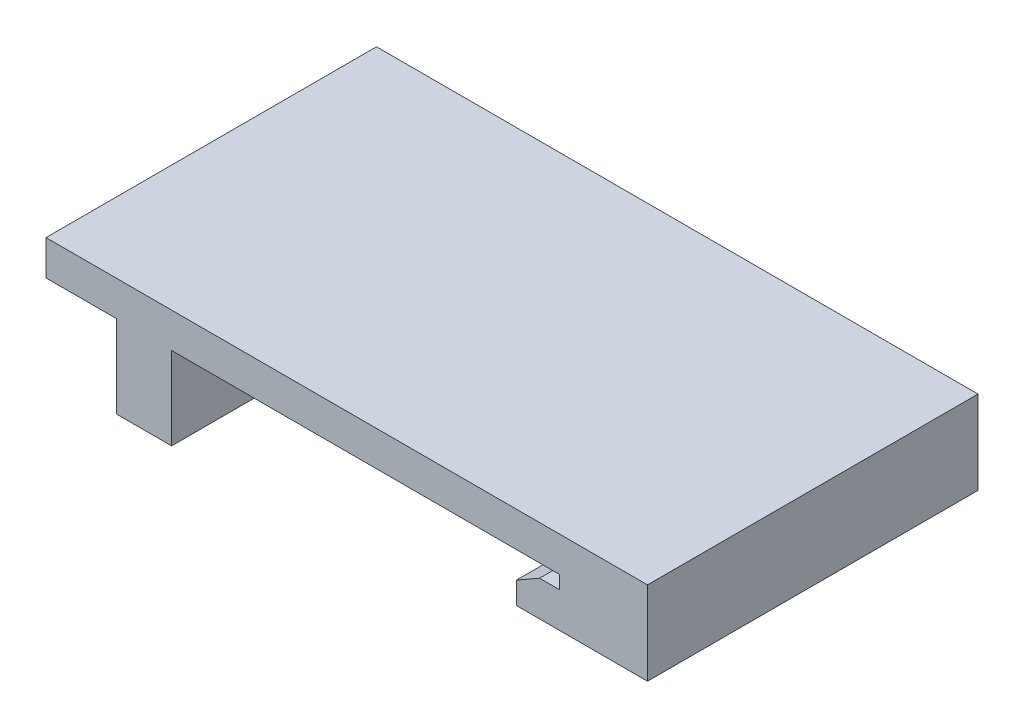
ISO-10303-21;
HEADER;
FILE_DESCRIPTION(('STEP AP214'),'2;1');
FILE_NAME('part.step','',(''),(''),'','','');
FILE_SCHEMA(('AUTOMOTIVE_DESIGN { 1 0 10303 214 1 1 1 1 }'));
ENDSEC;
DATA;
#1=APPLICATION_CONTEXT('core data for automotive mechanical design processes');
#2=APPLICATION_PROTOCOL_DEFINITION('international standard','automotive_design',2000,#1);
#3=PRODUCT_CONTEXT('',#1,'mechanical');
#4=PRODUCT('Part','Part','',(#3));
#5=PRODUCT_RELATED_PRODUCT_CATEGORY('part','',(#4));
#6=PRODUCT_DEFINITION_FORMATION('','',#4);
#7=PRODUCT_DEFINITION_CONTEXT('part definition',#1,'design');
#8=PRODUCT_DEFINITION('design','',#6,#7);
#9=PRODUCT_DEFINITION_SHAPE('','',#8);
#10=(LENGTH_UNIT() NAMED_UNIT(*) SI_UNIT(.MILLI.,.METRE.));
#11=(NAMED_UNIT(*) PLANE_ANGLE_UNIT() SI_UNIT($,.RADIAN.));
#12=(NAMED_UNIT(*) SI_UNIT($,.STERADIAN.) SOLID_ANGLE_UNIT());
#13=UNCERTAINTY_MEASURE_WITH_UNIT(LENGTH_MEASURE(1.E-05),#10,'distance_accuracy_value','');
#14=(GEOMETRIC_REPRESENTATION_CONTEXT(3) GLOBAL_UNCERTAINTY_ASSIGNED_CONTEXT((#13)) GLOBAL_UNIT_ASSIGNED_CONTEXT((#10,
#11,#12)) REPRESENTATION_CONTEXT('',''));
#15=CARTESIAN_POINT('',(0.,0.,0.));
#16=DIRECTION('',(0.,0.,1.));
#17=DIRECTION('',(1.,0.,0.));
#18=AXIS2_PLACEMENT_3D('',#15,#16,#17);
#19=CARTESIAN_POINT('',(0.,0.,30.));
#20=DIRECTION('',(0.,1.,0.));
#21=DIRECTION('',(0.,0.,1.));
#22=AXIS2_PLACEMENT_3D('',#19,#20,#21);
#23=PLANE('',#22);
#24=DIRECTION('',(1.,0.,0.));
#25=VECTOR('',#24,1.);
#26=CARTESIAN_POINT('',(0.,0.,0.));
#27=LINE('',#26,#25);
#28=CARTESIAN_POINT('',(-15.9,0.,0.));
#29=VERTEX_POINT('',#28);
#30=CARTESIAN_POINT('',(19.3,0.,0.));
#31=VERTEX_POINT('',#30);
#32=EDGE_CURVE('E111',#29,#31,#27,.T.);
#33=ORIENTED_EDGE('',*,*,#32,.T.);
#34=DIRECTION('',(0.,0.,-1.));
#35=VECTOR('',#34,1.);
#36=CARTESIAN_POINT('',(19.3,0.,30.));
#37=LINE('',#36,#35);
#38=CARTESIAN_POINT('',(19.3,0.,30.));
#39=VERTEX_POINT('',#38);
#40=EDGE_CURVE('E11',#39,#31,#37,.T.);
#41=ORIENTED_EDGE('',*,*,#40,.F.);
#42=DIRECTION('',(1.,0.,0.));
#43=VECTOR('',#42,1.);
#44=CARTESIAN_POINT('',(-15.9,0.,30.));
#45=LINE('',#44,#43);
#46=CARTESIAN_POINT('',(-15.9,0.,30.));
#47=VERTEX_POINT('',#46);
#48=EDGE_CURVE('E117',#47,#39,#45,.T.);
#49=ORIENTED_EDGE('',*,*,#48,.F.);
#50=DIRECTION('',(0.,0.,-1.));
#51=VECTOR('',#50,1.);
#52=CARTESIAN_POINT('',(-15.9,0.,30.));
#53=LINE('',#52,#51);
#54=EDGE_CURVE('E170',#47,#29,#53,.T.);
#55=ORIENTED_EDGE('',*,*,#54,.T.);
#56=EDGE_LOOP('',(#33,#41,#49,#55));
#57=FACE_BOUND('',#56,.T.);
#58=ADVANCED_FACE('F43',(#57),#23,.F.);
#59=CARTESIAN_POINT('',(19.3,0.,30.));
#60=DIRECTION('',(1.,0.,0.));
#61=DIRECTION('',(0.,0.,-1.));
#62=AXIS2_PLACEMENT_3D('',#59,#60,#61);
#63=PLANE('',#62);
#64=DIRECTION('',(0.,-1.,0.));
#65=VECTOR('',#64,1.);
#66=CARTESIAN_POINT('',(19.3,0.,0.));
#67=LINE('',#66,#65);
#68=CARTESIAN_POINT('',(19.3,-1.2,0.));
#69=VERTEX_POINT('',#68);
#70=EDGE_CURVE('E176',#31,#69,#67,.T.);
#71=ORIENTED_EDGE('',*,*,#70,.T.);
#72=DIRECTION('',(0.,0.,-1.));
#73=VECTOR('',#72,1.);
#74=CARTESIAN_POINT('',(19.3,-1.2,30.));
#75=LINE('',#74,#73);
#76=CARTESIAN_POINT('',(19.3,-1.2,30.));
#77=VERTEX_POINT('',#76);
#78=EDGE_CURVE('E52',#77,#69,#75,.T.);
#79=ORIENTED_EDGE('',*,*,#78,.F.);
#80=DIRECTION('',(0.,-1.,0.));
#81=VECTOR('',#80,1.);
#82=CARTESIAN_POINT('',(19.3,0.,30.));
#83=LINE('',#82,#81);
#84=EDGE_CURVE('E303',#39,#77,#83,.T.);
#85=ORIENTED_EDGE('',*,*,#84,.F.);
#86=ORIENTED_EDGE('',*,*,#40,.T.);
#87=EDGE_LOOP('',(#71,#79,#85,#86));
#88=FACE_BOUND('',#87,.T.);
#89=ADVANCED_FACE('F311',(#88),#63,.F.);
#90=CARTESIAN_POINT('',(19.3,-1.2,30.));
#91=DIRECTION('',(0.,-1.,0.));
#92=DIRECTION('',(0.,0.,-1.));
#93=AXIS2_PLACEMENT_3D('',#90,#91,#92);
#94=PLANE('',#93);
#95=DIRECTION('',(-1.,0.,0.));
#96=VECTOR('',#95,1.);
#97=CARTESIAN_POINT('',(19.3,-1.2,0.));
#98=LINE('',#97,#96);
#99=CARTESIAN_POINT('',(17.5,-1.2,0.));
#100=VERTEX_POINT('',#99);
#101=EDGE_CURVE('E180',#69,#100,#98,.T.);
#102=ORIENTED_EDGE('',*,*,#101,.T.);
#103=DIRECTION('',(0.,0.,-1.));
#104=VECTOR('',#103,1.);
#105=CARTESIAN_POINT('',(17.5,-1.2,30.));
#106=LINE('',#105,#104);
#107=CARTESIAN_POINT('',(17.5,-1.2,30.));
#108=VERTEX_POINT('',#107);
#109=EDGE_CURVE('E242',#108,#100,#106,.T.);
#110=ORIENTED_EDGE('',*,*,#109,.F.);
#111=DIRECTION('',(-1.,0.,0.));
#112=VECTOR('',#111,1.);
#113=CARTESIAN_POINT('',(19.3,-1.2,30.));
#114=LINE('',#113,#112);
#115=EDGE_CURVE('E253',#77,#108,#114,.T.);
#116=ORIENTED_EDGE('',*,*,#115,.F.);
#117=ORIENTED_EDGE('',*,*,#78,.T.);
#118=EDGE_LOOP('',(#102,#110,#116,#117));
#119=FACE_BOUND('',#118,.T.);
#120=ADVANCED_FACE('F251',(#119),#94,.F.);
#121=CARTESIAN_POINT('',(17.5,-1.2,30.));
#122=DIRECTION('',(0.496138938356834,-0.868243142124459,0.));
#123=DIRECTION('',(0.868243142124459,0.496138938356834,0.));
#124=AXIS2_PLACEMENT_3D('',#121,#122,#123);
#125=PLANE('',#124);
#126=DIRECTION('',(-0.868243142124459,-0.496138938356834,0.));
#127=VECTOR('',#126,1.);
#128=CARTESIAN_POINT('',(17.5,-1.2,0.));
#129=LINE('',#128,#127);
#130=CARTESIAN_POINT('',(15.4,-2.4,0.));
#131=VERTEX_POINT('',#130);
#132=EDGE_CURVE('E183',#100,#131,#129,.T.);
#133=ORIENTED_EDGE('',*,*,#132,.T.);
#134=DIRECTION('',(0.,0.,-1.));
#135=VECTOR('',#134,1.);
#136=CARTESIAN_POINT('',(15.4,-2.4,30.));
#137=LINE('',#136,#135);
#138=CARTESIAN_POINT('',(15.4,-2.4,30.));
#139=VERTEX_POINT('',#138);
#140=EDGE_CURVE('E238',#139,#131,#137,.T.);
#141=ORIENTED_EDGE('',*,*,#140,.F.);
#142=DIRECTION('',(-0.868243142124459,-0.496138938356834,0.));
#143=VECTOR('',#142,1.);
#144=CARTESIAN_POINT('',(17.5,-1.2,30.));
#145=LINE('',#144,#143);
#146=EDGE_CURVE('E272',#108,#139,#145,.T.);
#147=ORIENTED_EDGE('',*,*,#146,.F.);
#148=ORIENTED_EDGE('',*,*,#109,.T.);
#149=EDGE_LOOP('',(#133,#141,#147,#148));
#150=FACE_BOUND('',#149,.T.);
#151=ADVANCED_FACE('F262',(#150),#125,.F.);
#152=CARTESIAN_POINT('',(15.4,-2.4,30.));
#153=DIRECTION('',(1.,0.,0.));
#154=DIRECTION('',(0.,0.,-1.));
#155=AXIS2_PLACEMENT_3D('',#152,#153,#154);
#156=PLANE('',#155);
#157=DIRECTION('',(0.,-1.,0.));
#158=VECTOR('',#157,1.);
#159=CARTESIAN_POINT('',(15.4,-2.4,0.));
#160=LINE('',#159,#158);
#161=CARTESIAN_POINT('',(15.4,-4.4,0.));
#162=VERTEX_POINT('',#161);
#163=EDGE_CURVE('E186',#131,#162,#160,.T.);
#164=ORIENTED_EDGE('',*,*,#163,.T.);
#165=DIRECTION('',(0.,0.,-1.));
#166=VECTOR('',#165,1.);
#167=CARTESIAN_POINT('',(15.4,-4.4,30.));
#168=LINE('',#167,#166);
#169=CARTESIAN_POINT('',(15.4,-4.4,30.));
#170=VERTEX_POINT('',#169);
#171=EDGE_CURVE('E234',#170,#162,#168,.T.);
#172=ORIENTED_EDGE('',*,*,#171,.F.);
#173=DIRECTION('',(0.,-1.,0.));
#174=VECTOR('',#173,1.);
#175=CARTESIAN_POINT('',(15.4,-2.4,30.));
#176=LINE('',#175,#174);
#177=EDGE_CURVE('E268',#139,#170,#176,.T.);
#178=ORIENTED_EDGE('',*,*,#177,.F.);
#179=ORIENTED_EDGE('',*,*,#140,.T.);
#180=EDGE_LOOP('',(#164,#172,#178,#179));
#181=FACE_BOUND('',#180,.T.);
#182=ADVANCED_FACE('F266',(#181),#156,.F.);
#183=CARTESIAN_POINT('',(15.4,-4.4,30.));
#184=DIRECTION('',(0.,1.,0.));
#185=DIRECTION('',(0.,0.,1.));
#186=AXIS2_PLACEMENT_3D('',#183,#184,#185);
#187=PLANE('',#186);
#188=DIRECTION('',(1.,0.,0.));
#189=VECTOR('',#188,1.);
#190=CARTESIAN_POINT('',(15.4,-4.4,0.));
#191=LINE('',#190,#189);
#192=CARTESIAN_POINT('',(27.3,-4.4,0.));
#193=VERTEX_POINT('',#192);
#194=EDGE_CURVE('E189',#162,#193,#191,.T.);
#195=ORIENTED_EDGE('',*,*,#194,.T.);
#196=DIRECTION('',(0.,0.,-1.));
#197=VECTOR('',#196,1.);
#198=CARTESIAN_POINT('',(27.3,-4.4,30.));
#199=LINE('',#198,#197);
#200=CARTESIAN_POINT('',(27.3,-4.4,30.));
#201=VERTEX_POINT('',#200);
#202=EDGE_CURVE('E230',#201,#193,#199,.T.);
#203=ORIENTED_EDGE('',*,*,#202,.F.);
#204=DIRECTION('',(1.,0.,0.));
#205=VECTOR('',#204,1.);
#206=CARTESIAN_POINT('',(15.4,-4.4,30.));
#207=LINE('',#206,#205);
#208=EDGE_CURVE('E271',#170,#201,#207,.T.);
#209=ORIENTED_EDGE('',*,*,#208,.F.);
#210=ORIENTED_EDGE('',*,*,#171,.T.);
#211=EDGE_LOOP('',(#195,#203,#209,#210));
#212=FACE_BOUND('',#211,.T.);
#213=ADVANCED_FACE('F323',(#212),#187,.F.);
#214=CARTESIAN_POINT('',(27.3,3.17499999999999,30.));
#215=DIRECTION('',(-1.,0.,0.));
#216=DIRECTION('',(0.,-1.,0.));
#217=AXIS2_PLACEMENT_3D('',#214,#215,#216);
#218=PLANE('',#217);
#219=DIRECTION('',(0.,1.,0.));
#220=VECTOR('',#219,1.);
#221=CARTESIAN_POINT('',(27.3,3.17499999999999,0.));
#222=LINE('',#221,#220);
#223=CARTESIAN_POINT('',(27.3,3.17499999999999,0.));
#224=VERTEX_POINT('',#223);
#225=EDGE_CURVE('E192',#193,#224,#222,.T.);
#226=ORIENTED_EDGE('',*,*,#225,.T.);
#227=DIRECTION('',(0.,0.,-1.));
#228=VECTOR('',#227,1.);
#229=CARTESIAN_POINT('',(27.3,3.17499999999999,30.));
#230=LINE('',#229,#228);
#231=CARTESIAN_POINT('',(27.3,3.17499999999999,30.));
#232=VERTEX_POINT('',#231);
#233=EDGE_CURVE('E226',#232,#224,#230,.T.);
#234=ORIENTED_EDGE('',*,*,#233,.F.);
#235=DIRECTION('',(0.,1.,0.));
#236=VECTOR('',#235,1.);
#237=CARTESIAN_POINT('',(27.3,3.17499999999999,30.));
#238=LINE('',#237,#236);
#239=EDGE_CURVE('E276',#201,#232,#238,.T.);
#240=ORIENTED_EDGE('',*,*,#239,.F.);
#241=ORIENTED_EDGE('',*,*,#202,.T.);
#242=EDGE_LOOP('',(#226,#234,#240,#241));
#243=FACE_BOUND('',#242,.T.);
#244=ADVANCED_FACE('F326',(#243),#218,.F.);
#245=CARTESIAN_POINT('',(27.3,3.17499999999999,30.));
#246=DIRECTION('',(0.,-1.,0.));
#247=DIRECTION('',(0.,0.,-1.));
#248=AXIS2_PLACEMENT_3D('',#245,#246,#247);
#249=PLANE('',#248);
#250=DIRECTION('',(-1.,0.,0.));
#251=VECTOR('',#250,1.);
#252=CARTESIAN_POINT('',(27.3,3.17499999999999,0.));
#253=LINE('',#252,#251);
#254=CARTESIAN_POINT('',(-27.3,3.17499999999999,0.));
#255=VERTEX_POINT('',#254);
#256=EDGE_CURVE('E195',#224,#255,#253,.T.);
#257=ORIENTED_EDGE('',*,*,#256,.T.);
#258=DIRECTION('',(0.,0.,-1.));
#259=VECTOR('',#258,1.);
#260=CARTESIAN_POINT('',(-27.3,3.17499999999999,30.));
#261=LINE('',#260,#259);
#262=CARTESIAN_POINT('',(-27.3,3.17499999999999,30.));
#263=VERTEX_POINT('',#262);
#264=EDGE_CURVE('E222',#263,#255,#261,.T.);
#265=ORIENTED_EDGE('',*,*,#264,.F.);
#266=DIRECTION('',(-1.,0.,0.));
#267=VECTOR('',#266,1.);
#268=CARTESIAN_POINT('',(27.3,3.17499999999999,30.));
#269=LINE('',#268,#267);
#270=EDGE_CURVE('E283',#232,#263,#269,.T.);
#271=ORIENTED_EDGE('',*,*,#270,.F.);
#272=ORIENTED_EDGE('',*,*,#233,.T.);
#273=EDGE_LOOP('',(#257,#265,#271,#272));
#274=FACE_BOUND('',#273,.T.);
#275=ADVANCED_FACE('F330',(#274),#249,.F.);
#276=CARTESIAN_POINT('',(-27.3,3.17499999999999,30.));
#277=DIRECTION('',(1.,0.,0.));
#278=DIRECTION('',(0.,0.,-1.));
#279=AXIS2_PLACEMENT_3D('',#276,#277,#278);
#280=PLANE('',#279);
#281=DIRECTION('',(0.,-1.,0.));
#282=VECTOR('',#281,1.);
#283=CARTESIAN_POINT('',(-27.3,3.17499999999999,0.));
#284=LINE('',#283,#282);
#285=CARTESIAN_POINT('',(-27.3,0.,0.));
#286=VERTEX_POINT('',#285);
#287=EDGE_CURVE('E198',#255,#286,#284,.T.);
#288=ORIENTED_EDGE('',*,*,#287,.T.);
#289=DIRECTION('',(0.,0.,-1.));
#290=VECTOR('',#289,1.);
#291=CARTESIAN_POINT('',(-27.3,0.,30.));
#292=LINE('',#291,#290);
#293=CARTESIAN_POINT('',(-27.3,0.,30.));
#294=VERTEX_POINT('',#293);
#295=EDGE_CURVE('E218',#294,#286,#292,.T.);
#296=ORIENTED_EDGE('',*,*,#295,.F.);
#297=DIRECTION('',(0.,-1.,0.));
#298=VECTOR('',#297,1.);
#299=CARTESIAN_POINT('',(-27.3,3.17499999999999,30.));
#300=LINE('',#299,#298);
#301=EDGE_CURVE('E286',#263,#294,#300,.T.);
#302=ORIENTED_EDGE('',*,*,#301,.F.);
#303=ORIENTED_EDGE('',*,*,#264,.T.);
#304=EDGE_LOOP('',(#288,#296,#302,#303));
#305=FACE_BOUND('',#304,.T.);
#306=ADVANCED_FACE('F294',(#305),#280,.F.);
#307=CARTESIAN_POINT('',(-27.3,0.,30.));
#308=DIRECTION('',(0.,1.,0.));
#309=DIRECTION('',(-1.,0.,0.));
#310=AXIS2_PLACEMENT_3D('',#307,#308,#309);
#311=PLANE('',#310);
#312=DIRECTION('',(1.,0.,0.));
#313=VECTOR('',#312,1.);
#314=CARTESIAN_POINT('',(-27.3,0.,0.));
#315=LINE('',#314,#313);
#316=CARTESIAN_POINT('',(-20.9,0.,0.));
#317=VERTEX_POINT('',#316);
#318=EDGE_CURVE('E201',#286,#317,#315,.T.);
#319=ORIENTED_EDGE('',*,*,#318,.T.);
#320=DIRECTION('',(0.,0.,-1.));
#321=VECTOR('',#320,1.);
#322=CARTESIAN_POINT('',(-20.9,0.,30.));
#323=LINE('',#322,#321);
#324=CARTESIAN_POINT('',(-20.9,0.,30.));
#325=VERTEX_POINT('',#324);
#326=EDGE_CURVE('E163',#325,#317,#323,.T.);
#327=ORIENTED_EDGE('',*,*,#326,.F.);
#328=DIRECTION('',(1.,0.,0.));
#329=VECTOR('',#328,1.);
#330=CARTESIAN_POINT('',(-27.3,0.,30.));
#331=LINE('',#330,#329);
#332=EDGE_CURVE('E152',#294,#325,#331,.T.);
#333=ORIENTED_EDGE('',*,*,#332,.F.);
#334=ORIENTED_EDGE('',*,*,#295,.T.);
#335=EDGE_LOOP('',(#319,#327,#333,#334));
#336=FACE_BOUND('',#335,.T.);
#337=ADVANCED_FACE('F298',(#336),#311,.F.);
#338=CARTESIAN_POINT('',(-20.9,0.,30.));
#339=DIRECTION('',(1.,0.,0.));
#340=DIRECTION('',(0.,0.,-1.));
#341=AXIS2_PLACEMENT_3D('',#338,#339,#340);
#342=PLANE('',#341);
#343=CARTESIAN_POINT('',(-20.9,-3.75,7.5));
#344=DIRECTION('',(-1.,0.,0.));
#345=DIRECTION('',(0.,0.,1.));
#346=AXIS2_PLACEMENT_3D('',#343,#344,#345);
#347=CIRCLE('',#346,1.275);
#348=CARTESIAN_POINT('',(-20.9,-3.75,8.775));
#349=VERTEX_POINT('',#348);
#350=EDGE_CURVE('E365',#349,#349,#347,.T.);
#351=ORIENTED_EDGE('',*,*,#350,.F.);
#352=EDGE_LOOP('',(#351));
#353=FACE_BOUND('',#352,.T.);
#354=CARTESIAN_POINT('',(-20.9,-3.75,22.5));
#355=DIRECTION('',(-1.,0.,0.));
#356=DIRECTION('',(0.,0.,1.));
#357=AXIS2_PLACEMENT_3D('',#354,#355,#356);
#358=CIRCLE('',#357,1.275);
#359=CARTESIAN_POINT('',(-20.9,-3.75,23.775));
#360=VERTEX_POINT('',#359);
#361=EDGE_CURVE('E308',#360,#360,#358,.T.);
#362=ORIENTED_EDGE('',*,*,#361,.F.);
#363=EDGE_LOOP('',(#362));
#364=FACE_BOUND('',#363,.T.);
#365=DIRECTION('',(0.,-1.,0.));
#366=VECTOR('',#365,1.);
#367=CARTESIAN_POINT('',(-20.9,0.,0.));
#368=LINE('',#367,#366);
#369=CARTESIAN_POINT('',(-20.9,-7.5,0.));
#370=VERTEX_POINT('',#369);
#371=EDGE_CURVE('E161',#317,#370,#368,.T.);
#372=ORIENTED_EDGE('',*,*,#371,.T.);
#373=DIRECTION('',(0.,0.,-1.));
#374=VECTOR('',#373,1.);
#375=CARTESIAN_POINT('',(-20.9,-7.5,30.));
#376=LINE('',#375,#374);
#377=CARTESIAN_POINT('',(-20.9,-7.5,30.));
#378=VERTEX_POINT('',#377);
#379=EDGE_CURVE('E158',#378,#370,#376,.T.);
#380=ORIENTED_EDGE('',*,*,#379,.F.);
#381=DIRECTION('',(0.,-1.,0.));
#382=VECTOR('',#381,1.);
#383=CARTESIAN_POINT('',(-20.9,0.,30.));
#384=LINE('',#383,#382);
#385=EDGE_CURVE('E146',#325,#378,#384,.T.);
#386=ORIENTED_EDGE('',*,*,#385,.F.);
#387=ORIENTED_EDGE('',*,*,#326,.T.);
#388=EDGE_LOOP('',(#372,#380,#386,#387));
#389=FACE_BOUND('',#388,.T.);
#390=ADVANCED_FACE('F159',(#353,#364,#389),#342,.F.);
#391=CARTESIAN_POINT('',(-20.9,-7.5,30.));
#392=DIRECTION('',(0.,1.,0.));
#393=DIRECTION('',(0.,0.,1.));
#394=AXIS2_PLACEMENT_3D('',#391,#392,#393);
#395=PLANE('',#394);
#396=DIRECTION('',(1.,0.,0.));
#397=VECTOR('',#396,1.);
#398=CARTESIAN_POINT('',(-20.9,-7.5,0.));
#399=LINE('',#398,#397);
#400=CARTESIAN_POINT('',(-15.9,-7.5,0.));
#401=VERTEX_POINT('',#400);
#402=EDGE_CURVE('E104',#370,#401,#399,.T.);
#403=ORIENTED_EDGE('',*,*,#402,.T.);
#404=DIRECTION('',(0.,0.,-1.));
#405=VECTOR('',#404,1.);
#406=CARTESIAN_POINT('',(-15.9,-7.5,30.));
#407=LINE('',#406,#405);
#408=CARTESIAN_POINT('',(-15.9,-7.5,30.));
#409=VERTEX_POINT('',#408);
#410=EDGE_CURVE('E164',#409,#401,#407,.T.);
#411=ORIENTED_EDGE('',*,*,#410,.F.);
#412=DIRECTION('',(1.,0.,0.));
#413=VECTOR('',#412,1.);
#414=CARTESIAN_POINT('',(-20.9,-7.5,30.));
#415=LINE('',#414,#413);
#416=EDGE_CURVE('E150',#378,#409,#415,.T.);
#417=ORIENTED_EDGE('',*,*,#416,.F.);
#418=ORIENTED_EDGE('',*,*,#379,.T.);
#419=EDGE_LOOP('',(#403,#411,#417,#418));
#420=FACE_BOUND('',#419,.T.);
#421=ADVANCED_FACE('F166',(#420),#395,.F.);
#422=CARTESIAN_POINT('',(-15.9,-7.5,30.));
#423=DIRECTION('',(-1.,0.,0.));
#424=DIRECTION('',(0.,0.,1.));
#425=AXIS2_PLACEMENT_3D('',#422,#423,#424);
#426=PLANE('',#425);
#427=CARTESIAN_POINT('',(-15.9,-3.75,7.5));
#428=DIRECTION('',(-1.,0.,0.));
#429=DIRECTION('',(0.,0.,1.));
#430=AXIS2_PLACEMENT_3D('',#427,#428,#429);
#431=CIRCLE('',#430,1.275);
#432=CARTESIAN_POINT('',(-15.9,-3.75,8.775));
#433=VERTEX_POINT('',#432);
#434=EDGE_CURVE('E177',#433,#433,#431,.F.);
#435=ORIENTED_EDGE('',*,*,#434,.F.);
#436=EDGE_LOOP('',(#435));
#437=FACE_BOUND('',#436,.T.);
#438=CARTESIAN_POINT('',(-15.9,-3.75,22.5));
#439=DIRECTION('',(-1.,0.,0.));
#440=DIRECTION('',(0.,0.,1.));
#441=AXIS2_PLACEMENT_3D('',#438,#439,#440);
#442=CIRCLE('',#441,1.275);
#443=CARTESIAN_POINT('',(-15.9,-3.75,23.775));
#444=VERTEX_POINT('',#443);
#445=EDGE_CURVE('E372',#444,#444,#442,.F.);
#446=ORIENTED_EDGE('',*,*,#445,.F.);
#447=EDGE_LOOP('',(#446));
#448=FACE_BOUND('',#447,.T.);
#449=DIRECTION('',(0.,1.,0.));
#450=VECTOR('',#449,1.);
#451=CARTESIAN_POINT('',(-15.9,-7.5,0.));
#452=LINE('',#451,#450);
#453=EDGE_CURVE('E208',#401,#29,#452,.T.);
#454=ORIENTED_EDGE('',*,*,#453,.T.);
#455=ORIENTED_EDGE('',*,*,#54,.F.);
#456=DIRECTION('',(0.,1.,0.));
#457=VECTOR('',#456,1.);
#458=CARTESIAN_POINT('',(-15.9,-7.5,30.));
#459=LINE('',#458,#457);
#460=EDGE_CURVE('E60',#409,#47,#459,.T.);
#461=ORIENTED_EDGE('',*,*,#460,.F.);
#462=ORIENTED_EDGE('',*,*,#410,.T.);
#463=EDGE_LOOP('',(#454,#455,#461,#462));
#464=FACE_BOUND('',#463,.T.);
#465=ADVANCED_FACE('F300',(#437,#448,#464),#426,.F.);
#466=CARTESIAN_POINT('',(0.,0.,30.));
#467=DIRECTION('',(0.,0.,-1.));
#468=DIRECTION('',(-1.,0.,0.));
#469=AXIS2_PLACEMENT_3D('',#466,#467,#468);
#470=PLANE('',#469);
#471=ORIENTED_EDGE('',*,*,#48,.T.);
#472=ORIENTED_EDGE('',*,*,#84,.T.);
#473=ORIENTED_EDGE('',*,*,#115,.T.);
#474=ORIENTED_EDGE('',*,*,#146,.T.);
#475=ORIENTED_EDGE('',*,*,#177,.T.);
#476=ORIENTED_EDGE('',*,*,#208,.T.);
#477=ORIENTED_EDGE('',*,*,#239,.T.);
#478=ORIENTED_EDGE('',*,*,#270,.T.);
#479=ORIENTED_EDGE('',*,*,#301,.T.);
#480=ORIENTED_EDGE('',*,*,#332,.T.);
#481=ORIENTED_EDGE('',*,*,#385,.T.);
#482=ORIENTED_EDGE('',*,*,#416,.T.);
#483=ORIENTED_EDGE('',*,*,#460,.T.);
#484=EDGE_LOOP('',(#471,#472,#473,#474,#475,#476,#477,#478,#479,#480,#481,#482,#483));
#485=FACE_BOUND('',#484,.T.);
#486=ADVANCED_FACE('F148',(#485),#470,.F.);
#487=CARTESIAN_POINT('',(0.,0.,0.));
#488=DIRECTION('',(0.,0.,-1.));
#489=DIRECTION('',(-1.,0.,0.));
#490=AXIS2_PLACEMENT_3D('',#487,#488,#489);
#491=PLANE('',#490);
#492=ORIENTED_EDGE('',*,*,#32,.F.);
#493=ORIENTED_EDGE('',*,*,#453,.F.);
#494=ORIENTED_EDGE('',*,*,#402,.F.);
#495=ORIENTED_EDGE('',*,*,#371,.F.);
#496=ORIENTED_EDGE('',*,*,#318,.F.);
#497=ORIENTED_EDGE('',*,*,#287,.F.);
#498=ORIENTED_EDGE('',*,*,#256,.F.);
#499=ORIENTED_EDGE('',*,*,#225,.F.);
#500=ORIENTED_EDGE('',*,*,#194,.F.);
#501=ORIENTED_EDGE('',*,*,#163,.F.);
#502=ORIENTED_EDGE('',*,*,#132,.F.);
#503=ORIENTED_EDGE('',*,*,#101,.F.);
#504=ORIENTED_EDGE('',*,*,#70,.F.);
#505=EDGE_LOOP('',(#492,#493,#494,#495,#496,#497,#498,#499,#500,#501,#502,#503,#504));
#506=FACE_BOUND('',#505,.T.);
#507=ADVANCED_FACE('F257',(#506),#491,.T.);
#508=CARTESIAN_POINT('',(-12.2937554159486,-3.75,22.5));
#509=DIRECTION('',(-1.,0.,0.));
#510=DIRECTION('',(0.,0.,1.));
#511=AXIS2_PLACEMENT_3D('',#508,#509,#510);
#512=CYLINDRICAL_SURFACE('',#511,1.275);
#513=ORIENTED_EDGE('',*,*,#445,.T.);
#514=EDGE_LOOP('',(#513));
#515=FACE_BOUND('',#514,.T.);
#516=ORIENTED_EDGE('',*,*,#361,.T.);
#517=EDGE_LOOP('',(#516));
#518=FACE_BOUND('',#517,.T.);
#519=ADVANCED_FACE('F349',(#515,#518),#512,.F.);
#520=CARTESIAN_POINT('',(-12.2937554159486,-3.75,7.5));
#521=DIRECTION('',(-1.,0.,0.));
#522=DIRECTION('',(0.,0.,1.));
#523=AXIS2_PLACEMENT_3D('',#520,#521,#522);
#524=CYLINDRICAL_SURFACE('',#523,1.275);
#525=ORIENTED_EDGE('',*,*,#434,.T.);
#526=EDGE_LOOP('',(#525));
#527=FACE_BOUND('',#526,.T.);
#528=ORIENTED_EDGE('',*,*,#350,.T.);
#529=EDGE_LOOP('',(#528));
#530=FACE_BOUND('',#529,.T.);
#531=ADVANCED_FACE('F354',(#527,#530),#524,.F.);
#532=CLOSED_SHELL('',(#58,#89,#120,#151,#182,#213,#244,#275,#306,#337,#390,#421,#465,#486,#507,
#519,#531));
#533=MANIFOLD_SOLID_BREP('B2',#532);
#534=ADVANCED_BREP_SHAPE_REPRESENTATION('',(#18,#533),#14);
#535=SHAPE_DEFINITION_REPRESENTATION(#9,#534);
ENDSEC;
END-ISO-10303-21;
